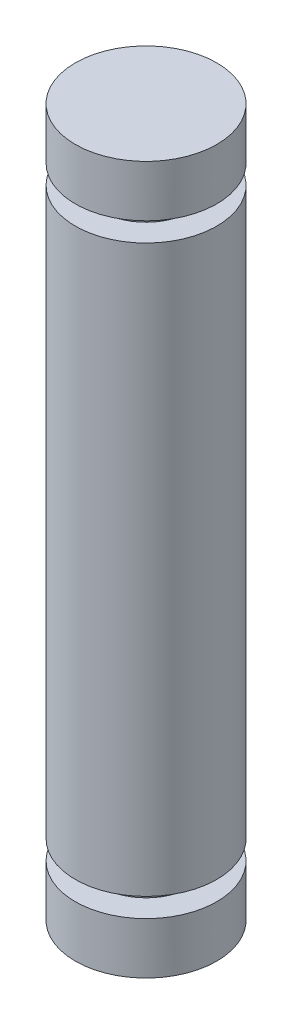
ISO-10303-21;
HEADER;
FILE_DESCRIPTION(('STEP AP214'),'2;1');
FILE_NAME('part.step','',(''),(''),'','','');
FILE_SCHEMA(('AUTOMOTIVE_DESIGN { 1 0 10303 214 1 1 1 1 }'));
ENDSEC;
DATA;
#1=APPLICATION_CONTEXT('core data for automotive mechanical design processes');
#2=APPLICATION_PROTOCOL_DEFINITION('international standard','automotive_design',2000,#1);
#3=PRODUCT_CONTEXT('',#1,'mechanical');
#4=PRODUCT('Part','Part','',(#3));
#5=PRODUCT_RELATED_PRODUCT_CATEGORY('part','',(#4));
#6=PRODUCT_DEFINITION_FORMATION('','',#4);
#7=PRODUCT_DEFINITION_CONTEXT('part definition',#1,'design');
#8=PRODUCT_DEFINITION('design','',#6,#7);
#9=PRODUCT_DEFINITION_SHAPE('','',#8);
#10=(LENGTH_UNIT() NAMED_UNIT(*) SI_UNIT(.MILLI.,.METRE.));
#11=(NAMED_UNIT(*) PLANE_ANGLE_UNIT() SI_UNIT($,.RADIAN.));
#12=(NAMED_UNIT(*) SI_UNIT($,.STERADIAN.) SOLID_ANGLE_UNIT());
#13=UNCERTAINTY_MEASURE_WITH_UNIT(LENGTH_MEASURE(1.E-05),#10,'distance_accuracy_value','');
#14=(GEOMETRIC_REPRESENTATION_CONTEXT(3) GLOBAL_UNCERTAINTY_ASSIGNED_CONTEXT((#13)) GLOBAL_UNIT_ASSIGNED_CONTEXT((#10,
#11,#12)) REPRESENTATION_CONTEXT('',''));
#15=CARTESIAN_POINT('',(0.,0.,0.));
#16=DIRECTION('',(0.,0.,1.));
#17=DIRECTION('',(1.,0.,0.));
#18=AXIS2_PLACEMENT_3D('',#15,#16,#17);
#19=CARTESIAN_POINT('',(0.,25.,0.));
#20=DIRECTION('',(0.,-1.,0.));
#21=DIRECTION('',(0.,0.,-1.));
#22=AXIS2_PLACEMENT_3D('',#19,#20,#21);
#23=CYLINDRICAL_SURFACE('',#22,2.5);
#24=CARTESIAN_POINT('',(0.,0.,0.));
#25=DIRECTION('',(0.,1.,0.));
#26=DIRECTION('',(0.,0.,1.));
#27=AXIS2_PLACEMENT_3D('',#24,#25,#26);
#28=CIRCLE('',#27,2.5);
#29=CARTESIAN_POINT('',(0.,0.,2.5));
#30=VERTEX_POINT('',#29);
#31=EDGE_CURVE('E39',#30,#30,#28,.T.);
#32=ORIENTED_EDGE('',*,*,#31,.T.);
#33=EDGE_LOOP('',(#32));
#34=FACE_BOUND('',#33,.T.);
#35=CARTESIAN_POINT('',(0.,1.82,0.));
#36=DIRECTION('',(0.,-1.,0.));
#37=DIRECTION('',(0.,0.,-1.));
#38=AXIS2_PLACEMENT_3D('',#35,#36,#37);
#39=CIRCLE('',#38,2.5);
#40=CARTESIAN_POINT('',(0.,1.82,-2.5));
#41=VERTEX_POINT('',#40);
#42=EDGE_CURVE('E48',#41,#41,#39,.T.);
#43=ORIENTED_EDGE('',*,*,#42,.T.);
#44=EDGE_LOOP('',(#43));
#45=FACE_BOUND('',#44,.T.);
#46=ADVANCED_FACE('F36',(#34,#45),#23,.T.);
#47=CARTESIAN_POINT('',(0.,0.,0.));
#48=DIRECTION('',(0.,1.,0.));
#49=DIRECTION('',(0.,0.,1.));
#50=AXIS2_PLACEMENT_3D('',#47,#48,#49);
#51=PLANE('',#50);
#52=ORIENTED_EDGE('',*,*,#31,.F.);
#53=EDGE_LOOP('',(#52));
#54=FACE_BOUND('',#53,.T.);
#55=ADVANCED_FACE('F105',(#54),#51,.F.);
#56=CARTESIAN_POINT('',(0.,1.82,2.5));
#57=DIRECTION('',(0.,1.,0.));
#58=DIRECTION('',(0.,0.,1.));
#59=AXIS2_PLACEMENT_3D('',#56,#57,#58);
#60=PLANE('',#59);
#61=CARTESIAN_POINT('',(0.,1.82,0.));
#62=DIRECTION('',(0.,-1.,0.));
#63=DIRECTION('',(0.,0.,-1.));
#64=AXIS2_PLACEMENT_3D('',#61,#62,#63);
#65=CIRCLE('',#64,1.6);
#66=CARTESIAN_POINT('',(0.,1.82,-1.6));
#67=VERTEX_POINT('',#66);
#68=EDGE_CURVE('E70',#67,#67,#65,.T.);
#69=ORIENTED_EDGE('',*,*,#68,.T.);
#70=EDGE_LOOP('',(#69));
#71=FACE_BOUND('',#70,.T.);
#72=ORIENTED_EDGE('',*,*,#42,.F.);
#73=EDGE_LOOP('',(#72));
#74=FACE_BOUND('',#73,.T.);
#75=ADVANCED_FACE('F112',(#71,#74),#60,.T.);
#76=CARTESIAN_POINT('',(0.,0.,0.));
#77=DIRECTION('',(0.,-1.,0.));
#78=DIRECTION('',(0.,0.,-1.));
#79=AXIS2_PLACEMENT_3D('',#76,#77,#78);
#80=CYLINDRICAL_SURFACE('',#79,1.6);
#81=CARTESIAN_POINT('',(0.,2.5,0.));
#82=DIRECTION('',(0.,-1.,0.));
#83=DIRECTION('',(0.,0.,-1.));
#84=AXIS2_PLACEMENT_3D('',#81,#82,#83);
#85=CIRCLE('',#84,1.6);
#86=CARTESIAN_POINT('',(0.,2.5,-1.6));
#87=VERTEX_POINT('',#86);
#88=EDGE_CURVE('E74',#87,#87,#85,.T.);
#89=ORIENTED_EDGE('',*,*,#88,.T.);
#90=EDGE_LOOP('',(#89));
#91=FACE_BOUND('',#90,.T.);
#92=ORIENTED_EDGE('',*,*,#68,.F.);
#93=EDGE_LOOP('',(#92));
#94=FACE_BOUND('',#93,.T.);
#95=ADVANCED_FACE('F99',(#91,#94),#80,.T.);
#96=CARTESIAN_POINT('',(0.,2.5,1.6));
#97=DIRECTION('',(0.,-1.,0.));
#98=DIRECTION('',(0.,0.,-1.));
#99=AXIS2_PLACEMENT_3D('',#96,#97,#98);
#100=PLANE('',#99);
#101=CARTESIAN_POINT('',(0.,2.5,0.));
#102=DIRECTION('',(0.,-1.,0.));
#103=DIRECTION('',(0.,0.,-1.));
#104=AXIS2_PLACEMENT_3D('',#101,#102,#103);
#105=CIRCLE('',#104,2.5);
#106=CARTESIAN_POINT('',(0.,2.5,-2.5));
#107=VERTEX_POINT('',#106);
#108=EDGE_CURVE('E54',#107,#107,#105,.T.);
#109=ORIENTED_EDGE('',*,*,#108,.T.);
#110=EDGE_LOOP('',(#109));
#111=FACE_BOUND('',#110,.T.);
#112=ORIENTED_EDGE('',*,*,#88,.F.);
#113=EDGE_LOOP('',(#112));
#114=FACE_BOUND('',#113,.T.);
#115=ADVANCED_FACE('F82',(#111,#114),#100,.T.);
#116=CARTESIAN_POINT('',(0.,22.5,0.));
#117=DIRECTION('',(0.,-1.,0.));
#118=DIRECTION('',(0.,0.,-1.));
#119=AXIS2_PLACEMENT_3D('',#116,#117,#118);
#120=CIRCLE('',#119,2.5);
#121=CARTESIAN_POINT('',(0.,22.5,-2.5));
#122=VERTEX_POINT('',#121);
#123=EDGE_CURVE('E59',#122,#122,#120,.T.);
#124=ORIENTED_EDGE('',*,*,#123,.T.);
#125=EDGE_LOOP('',(#124));
#126=FACE_BOUND('',#125,.T.);
#127=ORIENTED_EDGE('',*,*,#108,.F.);
#128=EDGE_LOOP('',(#127));
#129=FACE_BOUND('',#128,.T.);
#130=ADVANCED_FACE('F85',(#126,#129),#23,.T.);
#131=CARTESIAN_POINT('',(0.,23.18,2.5));
#132=DIRECTION('',(0.,-1.,0.));
#133=DIRECTION('',(0.,0.,-1.));
#134=AXIS2_PLACEMENT_3D('',#131,#132,#133);
#135=PLANE('',#134);
#136=CARTESIAN_POINT('',(0.,23.18,0.));
#137=DIRECTION('',(0.,-1.,0.));
#138=DIRECTION('',(0.,0.,-1.));
#139=AXIS2_PLACEMENT_3D('',#136,#137,#138);
#140=CIRCLE('',#139,2.5);
#141=CARTESIAN_POINT('',(0.,23.18,-2.5));
#142=VERTEX_POINT('',#141);
#143=EDGE_CURVE('E63',#142,#142,#140,.T.);
#144=ORIENTED_EDGE('',*,*,#143,.T.);
#145=EDGE_LOOP('',(#144));
#146=FACE_BOUND('',#145,.T.);
#147=CARTESIAN_POINT('',(0.,23.18,0.));
#148=DIRECTION('',(0.,-1.,0.));
#149=DIRECTION('',(0.,0.,-1.));
#150=AXIS2_PLACEMENT_3D('',#147,#148,#149);
#151=CIRCLE('',#150,1.6);
#152=CARTESIAN_POINT('',(0.,23.18,-1.6));
#153=VERTEX_POINT('',#152);
#154=EDGE_CURVE('E50',#153,#153,#151,.T.);
#155=ORIENTED_EDGE('',*,*,#154,.F.);
#156=EDGE_LOOP('',(#155));
#157=FACE_BOUND('',#156,.T.);
#158=ADVANCED_FACE('F87',(#146,#157),#135,.T.);
#159=CARTESIAN_POINT('',(0.,0.,0.));
#160=DIRECTION('',(0.,-1.,0.));
#161=DIRECTION('',(0.,0.,-1.));
#162=AXIS2_PLACEMENT_3D('',#159,#160,#161);
#163=CYLINDRICAL_SURFACE('',#162,1.6);
#164=ORIENTED_EDGE('',*,*,#154,.T.);
#165=EDGE_LOOP('',(#164));
#166=FACE_BOUND('',#165,.T.);
#167=CARTESIAN_POINT('',(0.,22.5,0.));
#168=DIRECTION('',(0.,-1.,0.));
#169=DIRECTION('',(0.,0.,-1.));
#170=AXIS2_PLACEMENT_3D('',#167,#168,#169);
#171=CIRCLE('',#170,1.6);
#172=CARTESIAN_POINT('',(0.,22.5,-1.6));
#173=VERTEX_POINT('',#172);
#174=EDGE_CURVE('E55',#173,#173,#171,.T.);
#175=ORIENTED_EDGE('',*,*,#174,.F.);
#176=EDGE_LOOP('',(#175));
#177=FACE_BOUND('',#176,.T.);
#178=ADVANCED_FACE('F95',(#166,#177),#163,.T.);
#179=CARTESIAN_POINT('',(0.,22.5,1.6));
#180=DIRECTION('',(0.,1.,0.));
#181=DIRECTION('',(0.,0.,1.));
#182=AXIS2_PLACEMENT_3D('',#179,#180,#181);
#183=PLANE('',#182);
#184=ORIENTED_EDGE('',*,*,#174,.T.);
#185=EDGE_LOOP('',(#184));
#186=FACE_BOUND('',#185,.T.);
#187=ORIENTED_EDGE('',*,*,#123,.F.);
#188=EDGE_LOOP('',(#187));
#189=FACE_BOUND('',#188,.T.);
#190=ADVANCED_FACE('F126',(#186,#189),#183,.T.);
#191=CARTESIAN_POINT('',(0.,25.,0.));
#192=DIRECTION('',(0.,1.,0.));
#193=DIRECTION('',(0.,0.,1.));
#194=AXIS2_PLACEMENT_3D('',#191,#192,#193);
#195=PLANE('',#194);
#196=CARTESIAN_POINT('',(0.,25.,0.));
#197=DIRECTION('',(0.,1.,0.));
#198=DIRECTION('',(0.,0.,1.));
#199=AXIS2_PLACEMENT_3D('',#196,#197,#198);
#200=CIRCLE('',#199,2.5);
#201=CARTESIAN_POINT('',(0.,25.,2.5));
#202=VERTEX_POINT('',#201);
#203=EDGE_CURVE('E10',#202,#202,#200,.T.);
#204=ORIENTED_EDGE('',*,*,#203,.T.);
#205=EDGE_LOOP('',(#204));
#206=FACE_BOUND('',#205,.T.);
#207=ADVANCED_FACE('F102',(#206),#195,.T.);
#208=ORIENTED_EDGE('',*,*,#203,.F.);
#209=EDGE_LOOP('',(#208));
#210=FACE_BOUND('',#209,.T.);
#211=ORIENTED_EDGE('',*,*,#143,.F.);
#212=EDGE_LOOP('',(#211));
#213=FACE_BOUND('',#212,.T.);
#214=ADVANCED_FACE('F89',(#210,#213),#23,.T.);
#215=CLOSED_SHELL('',(#46,#55,#75,#95,#115,#130,#158,#178,#190,#207,#214));
#216=MANIFOLD_SOLID_BREP('B2',#215);
#217=ADVANCED_BREP_SHAPE_REPRESENTATION('',(#18,#216),#14);
#218=SHAPE_DEFINITION_REPRESENTATION(#9,#217);
ENDSEC;
END-ISO-10303-21;
